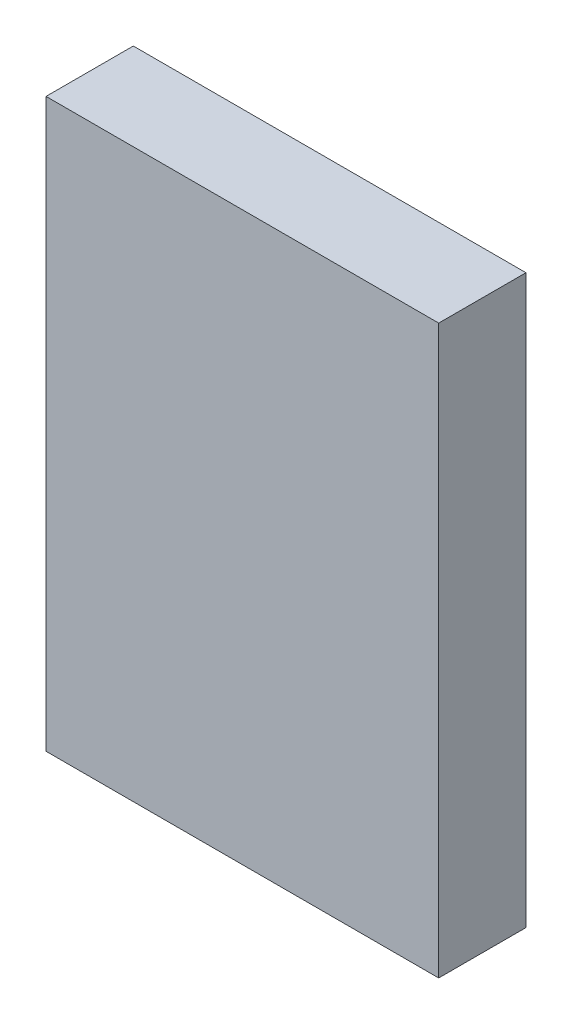
ISO-10303-21;
HEADER;
FILE_DESCRIPTION(('STEP AP214'),'2;1');
FILE_NAME('part.step','',(''),(''),'','','');
FILE_SCHEMA(('AUTOMOTIVE_DESIGN { 1 0 10303 214 1 1 1 1 }'));
ENDSEC;
DATA;
#1=APPLICATION_CONTEXT('core data for automotive mechanical design processes');
#2=APPLICATION_PROTOCOL_DEFINITION('international standard','automotive_design',2000,#1);
#3=PRODUCT_CONTEXT('',#1,'mechanical');
#4=PRODUCT('Part','Part','',(#3));
#5=PRODUCT_RELATED_PRODUCT_CATEGORY('part','',(#4));
#6=PRODUCT_DEFINITION_FORMATION('','',#4);
#7=PRODUCT_DEFINITION_CONTEXT('part definition',#1,'design');
#8=PRODUCT_DEFINITION('design','',#6,#7);
#9=PRODUCT_DEFINITION_SHAPE('','',#8);
#10=(LENGTH_UNIT() NAMED_UNIT(*) SI_UNIT(.MILLI.,.METRE.));
#11=(NAMED_UNIT(*) PLANE_ANGLE_UNIT() SI_UNIT($,.RADIAN.));
#12=(NAMED_UNIT(*) SI_UNIT($,.STERADIAN.) SOLID_ANGLE_UNIT());
#13=UNCERTAINTY_MEASURE_WITH_UNIT(LENGTH_MEASURE(1.E-05),#10,'distance_accuracy_value','');
#14=(GEOMETRIC_REPRESENTATION_CONTEXT(3) GLOBAL_UNCERTAINTY_ASSIGNED_CONTEXT((#13)) GLOBAL_UNIT_ASSIGNED_CONTEXT((#10,
#11,#12)) REPRESENTATION_CONTEXT('',''));
#15=CARTESIAN_POINT('',(0.,0.,0.));
#16=DIRECTION('',(0.,0.,1.));
#17=DIRECTION('',(1.,0.,0.));
#18=AXIS2_PLACEMENT_3D('',#15,#16,#17);
#19=CARTESIAN_POINT('',(2.25,3.25,1.));
#20=DIRECTION('',(-1.,0.,0.));
#21=DIRECTION('',(0.,-1.,0.));
#22=AXIS2_PLACEMENT_3D('',#19,#20,#21);
#23=PLANE('',#22);
#24=DIRECTION('',(0.,1.,0.));
#25=VECTOR('',#24,1.);
#26=CARTESIAN_POINT('',(2.25,3.25,0.));
#27=LINE('',#26,#25);
#28=CARTESIAN_POINT('',(2.25,-3.25,0.));
#29=VERTEX_POINT('',#28);
#30=CARTESIAN_POINT('',(2.25,3.25,0.));
#31=VERTEX_POINT('',#30);
#32=EDGE_CURVE('E97',#29,#31,#27,.T.);
#33=ORIENTED_EDGE('',*,*,#32,.T.);
#34=DIRECTION('',(0.,0.,-1.));
#35=VECTOR('',#34,1.);
#36=CARTESIAN_POINT('',(2.25,3.25,1.));
#37=LINE('',#36,#35);
#38=CARTESIAN_POINT('',(2.25,3.25,1.));
#39=VERTEX_POINT('',#38);
#40=EDGE_CURVE('E11',#39,#31,#37,.T.);
#41=ORIENTED_EDGE('',*,*,#40,.F.);
#42=DIRECTION('',(0.,1.,0.));
#43=VECTOR('',#42,1.);
#44=CARTESIAN_POINT('',(2.25,3.25,1.));
#45=LINE('',#44,#43);
#46=CARTESIAN_POINT('',(2.25,-3.25,1.));
#47=VERTEX_POINT('',#46);
#48=EDGE_CURVE('E85',#47,#39,#45,.T.);
#49=ORIENTED_EDGE('',*,*,#48,.F.);
#50=DIRECTION('',(0.,0.,-1.));
#51=VECTOR('',#50,1.);
#52=CARTESIAN_POINT('',(2.25,-3.25,1.));
#53=LINE('',#52,#51);
#54=EDGE_CURVE('E93',#47,#29,#53,.T.);
#55=ORIENTED_EDGE('',*,*,#54,.T.);
#56=EDGE_LOOP('',(#33,#41,#49,#55));
#57=FACE_BOUND('',#56,.T.);
#58=ADVANCED_FACE('F34',(#57),#23,.F.);
#59=CARTESIAN_POINT('',(-2.25,3.25,1.));
#60=DIRECTION('',(0.,-1.,0.));
#61=DIRECTION('',(0.,0.,-1.));
#62=AXIS2_PLACEMENT_3D('',#59,#60,#61);
#63=PLANE('',#62);
#64=DIRECTION('',(-1.,0.,0.));
#65=VECTOR('',#64,1.);
#66=CARTESIAN_POINT('',(-2.25,3.25,0.));
#67=LINE('',#66,#65);
#68=CARTESIAN_POINT('',(-2.25,3.25,0.));
#69=VERTEX_POINT('',#68);
#70=EDGE_CURVE('E89',#31,#69,#67,.T.);
#71=ORIENTED_EDGE('',*,*,#70,.T.);
#72=DIRECTION('',(0.,0.,-1.));
#73=VECTOR('',#72,1.);
#74=CARTESIAN_POINT('',(-2.25,3.25,1.));
#75=LINE('',#74,#73);
#76=CARTESIAN_POINT('',(-2.25,3.25,1.));
#77=VERTEX_POINT('',#76);
#78=EDGE_CURVE('E42',#77,#69,#75,.T.);
#79=ORIENTED_EDGE('',*,*,#78,.F.);
#80=DIRECTION('',(-1.,0.,0.));
#81=VECTOR('',#80,1.);
#82=CARTESIAN_POINT('',(-2.25,3.25,1.));
#83=LINE('',#82,#81);
#84=EDGE_CURVE('E80',#39,#77,#83,.T.);
#85=ORIENTED_EDGE('',*,*,#84,.F.);
#86=ORIENTED_EDGE('',*,*,#40,.T.);
#87=EDGE_LOOP('',(#71,#79,#85,#86));
#88=FACE_BOUND('',#87,.T.);
#89=ADVANCED_FACE('F88',(#88),#63,.F.);
#90=CARTESIAN_POINT('',(-2.25,3.25,1.));
#91=DIRECTION('',(1.,0.,0.));
#92=DIRECTION('',(0.,1.,0.));
#93=AXIS2_PLACEMENT_3D('',#90,#91,#92);
#94=PLANE('',#93);
#95=DIRECTION('',(0.,-1.,0.));
#96=VECTOR('',#95,1.);
#97=CARTESIAN_POINT('',(-2.25,3.25,0.));
#98=LINE('',#97,#96);
#99=CARTESIAN_POINT('',(-2.25,-3.25,0.));
#100=VERTEX_POINT('',#99);
#101=EDGE_CURVE('E67',#69,#100,#98,.T.);
#102=ORIENTED_EDGE('',*,*,#101,.T.);
#103=DIRECTION('',(0.,0.,-1.));
#104=VECTOR('',#103,1.);
#105=CARTESIAN_POINT('',(-2.25,-3.25,1.));
#106=LINE('',#105,#104);
#107=CARTESIAN_POINT('',(-2.25,-3.25,1.));
#108=VERTEX_POINT('',#107);
#109=EDGE_CURVE('E90',#108,#100,#106,.T.);
#110=ORIENTED_EDGE('',*,*,#109,.F.);
#111=DIRECTION('',(0.,-1.,0.));
#112=VECTOR('',#111,1.);
#113=CARTESIAN_POINT('',(-2.25,3.25,1.));
#114=LINE('',#113,#112);
#115=EDGE_CURVE('E83',#77,#108,#114,.T.);
#116=ORIENTED_EDGE('',*,*,#115,.F.);
#117=ORIENTED_EDGE('',*,*,#78,.T.);
#118=EDGE_LOOP('',(#102,#110,#116,#117));
#119=FACE_BOUND('',#118,.T.);
#120=ADVANCED_FACE('F91',(#119),#94,.F.);
#121=CARTESIAN_POINT('',(-2.25,-3.25,1.));
#122=DIRECTION('',(0.,1.,0.));
#123=DIRECTION('',(0.,0.,1.));
#124=AXIS2_PLACEMENT_3D('',#121,#122,#123);
#125=PLANE('',#124);
#126=DIRECTION('',(1.,0.,0.));
#127=VECTOR('',#126,1.);
#128=CARTESIAN_POINT('',(-2.25,-3.25,0.));
#129=LINE('',#128,#127);
#130=EDGE_CURVE('E73',#100,#29,#129,.T.);
#131=ORIENTED_EDGE('',*,*,#130,.T.);
#132=ORIENTED_EDGE('',*,*,#54,.F.);
#133=DIRECTION('',(1.,0.,0.));
#134=VECTOR('',#133,1.);
#135=CARTESIAN_POINT('',(-2.25,-3.25,1.));
#136=LINE('',#135,#134);
#137=EDGE_CURVE('E50',#108,#47,#136,.T.);
#138=ORIENTED_EDGE('',*,*,#137,.F.);
#139=ORIENTED_EDGE('',*,*,#109,.T.);
#140=EDGE_LOOP('',(#131,#132,#138,#139));
#141=FACE_BOUND('',#140,.T.);
#142=ADVANCED_FACE('F104',(#141),#125,.F.);
#143=CARTESIAN_POINT('',(0.,0.,1.));
#144=DIRECTION('',(0.,0.,1.));
#145=DIRECTION('',(1.,0.,0.));
#146=AXIS2_PLACEMENT_3D('',#143,#144,#145);
#147=PLANE('',#146);
#148=ORIENTED_EDGE('',*,*,#48,.T.);
#149=ORIENTED_EDGE('',*,*,#84,.T.);
#150=ORIENTED_EDGE('',*,*,#115,.T.);
#151=ORIENTED_EDGE('',*,*,#137,.T.);
#152=EDGE_LOOP('',(#148,#149,#150,#151));
#153=FACE_BOUND('',#152,.T.);
#154=ADVANCED_FACE('F81',(#153),#147,.T.);
#155=CARTESIAN_POINT('',(0.,0.,0.));
#156=DIRECTION('',(0.,0.,1.));
#157=DIRECTION('',(1.,0.,0.));
#158=AXIS2_PLACEMENT_3D('',#155,#156,#157);
#159=PLANE('',#158);
#160=ORIENTED_EDGE('',*,*,#32,.F.);
#161=ORIENTED_EDGE('',*,*,#130,.F.);
#162=ORIENTED_EDGE('',*,*,#101,.F.);
#163=ORIENTED_EDGE('',*,*,#70,.F.);
#164=EDGE_LOOP('',(#160,#161,#162,#163));
#165=FACE_BOUND('',#164,.T.);
#166=ADVANCED_FACE('F107',(#165),#159,.F.);
#167=CLOSED_SHELL('',(#58,#89,#120,#142,#154,#166));
#168=MANIFOLD_SOLID_BREP('B2',#167);
#169=ADVANCED_BREP_SHAPE_REPRESENTATION('',(#18,#168),#14);
#170=SHAPE_DEFINITION_REPRESENTATION(#9,#169);
ENDSEC;
END-ISO-10303-21;
